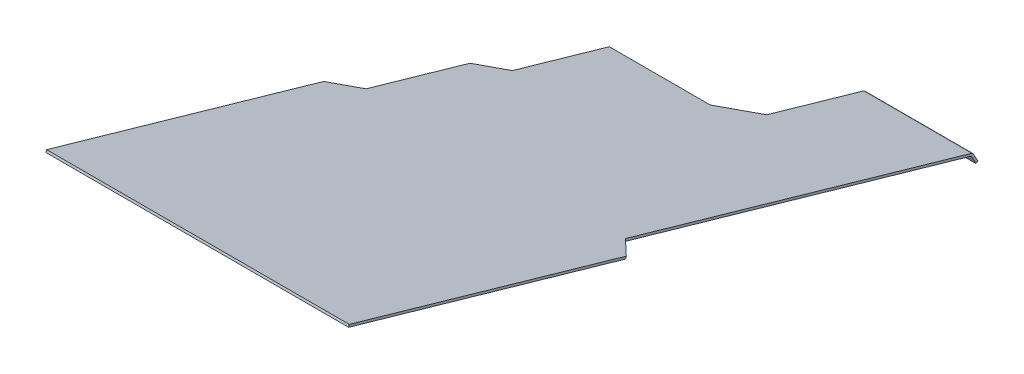
ISO-10303-21;
HEADER;
FILE_DESCRIPTION(('STEP AP214'),'2;1');
FILE_NAME('part.step','',(''),(''),'','','');
FILE_SCHEMA(('AUTOMOTIVE_DESIGN { 1 0 10303 214 1 1 1 1 }'));
ENDSEC;
DATA;
#1=APPLICATION_CONTEXT('core data for automotive mechanical design processes');
#2=APPLICATION_PROTOCOL_DEFINITION('international standard','automotive_design',2000,#1);
#3=PRODUCT_CONTEXT('',#1,'mechanical');
#4=PRODUCT('Part','Part','',(#3));
#5=PRODUCT_RELATED_PRODUCT_CATEGORY('part','',(#4));
#6=PRODUCT_DEFINITION_FORMATION('','',#4);
#7=PRODUCT_DEFINITION_CONTEXT('part definition',#1,'design');
#8=PRODUCT_DEFINITION('design','',#6,#7);
#9=PRODUCT_DEFINITION_SHAPE('','',#8);
#10=(LENGTH_UNIT() NAMED_UNIT(*) SI_UNIT(.MILLI.,.METRE.));
#11=(NAMED_UNIT(*) PLANE_ANGLE_UNIT() SI_UNIT($,.RADIAN.));
#12=(NAMED_UNIT(*) SI_UNIT($,.STERADIAN.) SOLID_ANGLE_UNIT());
#13=UNCERTAINTY_MEASURE_WITH_UNIT(LENGTH_MEASURE(1.E-05),#10,'distance_accuracy_value','');
#14=(GEOMETRIC_REPRESENTATION_CONTEXT(3) GLOBAL_UNCERTAINTY_ASSIGNED_CONTEXT((#13)) GLOBAL_UNIT_ASSIGNED_CONTEXT((#10,
#11,#12)) REPRESENTATION_CONTEXT('',''));
#15=CARTESIAN_POINT('',(0.,0.,0.));
#16=DIRECTION('',(0.,0.,1.));
#17=DIRECTION('',(1.,0.,0.));
#18=AXIS2_PLACEMENT_3D('',#15,#16,#17);
#19=CARTESIAN_POINT('',(105.,8.15369874467239,-236.405408560763));
#20=DIRECTION('',(-1.,0.,0.));
#21=DIRECTION('',(0.,-0.275637355816999,-0.961261695938319));
#22=AXIS2_PLACEMENT_3D('',#19,#20,#21);
#23=PLANE('',#22);
#24=DIRECTION('',(0.,-0.275637355816999,-0.961261695938319));
#25=VECTOR('',#24,1.);
#26=CARTESIAN_POINT('',(105.,6.61568003117108,-235.964388791456));
#27=LINE('',#26,#25);
#28=CARTESIAN_POINT('',(105.,6.61568003117108,-235.964388791456));
#29=VERTEX_POINT('',#28);
#30=CARTESIAN_POINT('',(105.,-48.5117911322299,-428.216727979123));
#31=VERTEX_POINT('',#30);
#32=EDGE_CURVE('E231',#29,#31,#27,.T.);
#33=ORIENTED_EDGE('',*,*,#32,.T.);
#34=DIRECTION('',(0.,0.961261695938319,-0.275637355816999));
#35=VECTOR('',#34,1.);
#36=CARTESIAN_POINT('',(105.,-46.9737724187286,-428.65774774843));
#37=LINE('',#36,#35);
#38=CARTESIAN_POINT('',(105.,-46.9737724187286,-428.65774774843));
#39=VERTEX_POINT('',#38);
#40=EDGE_CURVE('E163',#31,#39,#37,.T.);
#41=ORIENTED_EDGE('',*,*,#40,.T.);
#42=DIRECTION('',(0.,-0.275637355816999,-0.961261695938319));
#43=VECTOR('',#42,1.);
#44=CARTESIAN_POINT('',(105.,8.15369874467239,-236.405408560763));
#45=LINE('',#44,#43);
#46=CARTESIAN_POINT('',(105.,8.15369874467239,-236.405408560763));
#47=VERTEX_POINT('',#46);
#48=EDGE_CURVE('E237',#47,#39,#45,.T.);
#49=ORIENTED_EDGE('',*,*,#48,.F.);
#50=DIRECTION('',(0.,-0.961261695938319,0.275637355816999));
#51=VECTOR('',#50,1.);
#52=CARTESIAN_POINT('',(105.,8.15369874467239,-236.405408560763));
#53=LINE('',#52,#51);
#54=EDGE_CURVE('E217',#47,#29,#53,.T.);
#55=ORIENTED_EDGE('',*,*,#54,.T.);
#56=EDGE_LOOP('',(#33,#41,#49,#55));
#57=FACE_BOUND('',#56,.T.);
#58=ADVANCED_FACE('F18',(#57),#23,.F.);
#59=CARTESIAN_POINT('',(-105.,8.15369874467239,-236.405408560763));
#60=DIRECTION('',(-1.,0.,0.));
#61=DIRECTION('',(0.,-0.275637355816999,-0.961261695938319));
#62=AXIS2_PLACEMENT_3D('',#59,#60,#61);
#63=PLANE('',#62);
#64=DIRECTION('',(0.,0.961261695938319,-0.275637355816999));
#65=VECTOR('',#64,1.);
#66=CARTESIAN_POINT('',(-105.,-46.9737724187285,-428.65774774843));
#67=LINE('',#66,#65);
#68=CARTESIAN_POINT('',(-105.,-48.5117911322299,-428.216727979123));
#69=VERTEX_POINT('',#68);
#70=CARTESIAN_POINT('',(-105.,-46.9737724187285,-428.65774774843));
#71=VERTEX_POINT('',#70);
#72=EDGE_CURVE('E286',#69,#71,#67,.T.);
#73=ORIENTED_EDGE('',*,*,#72,.F.);
#74=DIRECTION('',(0.,-0.275637355816999,-0.961261695938319));
#75=VECTOR('',#74,1.);
#76=CARTESIAN_POINT('',(-105.,6.61568003117108,-235.964388791456));
#77=LINE('',#76,#75);
#78=CARTESIAN_POINT('',(-105.,6.61568003117108,-235.964388791456));
#79=VERTEX_POINT('',#78);
#80=EDGE_CURVE('E192',#79,#69,#77,.T.);
#81=ORIENTED_EDGE('',*,*,#80,.F.);
#82=DIRECTION('',(0.,-0.961261695938319,0.275637355816999));
#83=VECTOR('',#82,1.);
#84=CARTESIAN_POINT('',(-105.,8.15369874467239,-236.405408560763));
#85=LINE('',#84,#83);
#86=CARTESIAN_POINT('',(-105.,8.15369874467239,-236.405408560763));
#87=VERTEX_POINT('',#86);
#88=EDGE_CURVE('E213',#87,#79,#85,.T.);
#89=ORIENTED_EDGE('',*,*,#88,.F.);
#90=DIRECTION('',(0.,-0.275637355816999,-0.961261695938319));
#91=VECTOR('',#90,1.);
#92=CARTESIAN_POINT('',(-105.,8.15369874467239,-236.405408560763));
#93=LINE('',#92,#91);
#94=EDGE_CURVE('E227',#87,#71,#93,.T.);
#95=ORIENTED_EDGE('',*,*,#94,.T.);
#96=EDGE_LOOP('',(#73,#81,#89,#95));
#97=FACE_BOUND('',#96,.T.);
#98=ADVANCED_FACE('F303',(#97),#63,.T.);
#99=CARTESIAN_POINT('',(-105.,8.15369874467239,-236.405408560763));
#100=DIRECTION('',(0.,-0.275637355816999,-0.961261695938319));
#101=DIRECTION('',(1.,0.,0.));
#102=AXIS2_PLACEMENT_3D('',#99,#100,#101);
#103=PLANE('',#102);
#104=DIRECTION('',(1.,0.,0.));
#105=VECTOR('',#104,1.);
#106=CARTESIAN_POINT('',(-105.,8.15369874467239,-236.405408560763));
#107=LINE('',#106,#105);
#108=EDGE_CURVE('E225',#87,#47,#107,.T.);
#109=ORIENTED_EDGE('',*,*,#108,.F.);
#110=ORIENTED_EDGE('',*,*,#88,.T.);
#111=DIRECTION('',(1.,0.,0.));
#112=VECTOR('',#111,1.);
#113=CARTESIAN_POINT('',(-105.,6.61568003117108,-235.964388791456));
#114=LINE('',#113,#112);
#115=EDGE_CURVE('E234',#79,#29,#114,.T.);
#116=ORIENTED_EDGE('',*,*,#115,.T.);
#117=ORIENTED_EDGE('',*,*,#54,.F.);
#118=EDGE_LOOP('',(#109,#110,#116,#117));
#119=FACE_BOUND('',#118,.T.);
#120=ADVANCED_FACE('F310',(#119),#103,.F.);
#121=CARTESIAN_POINT('',(-105.,6.61568003117108,-235.964388791456));
#122=DIRECTION('',(0.,-0.961261695938319,0.275637355816999));
#123=DIRECTION('',(0.,-0.275637355816999,-0.961261695938319));
#124=AXIS2_PLACEMENT_3D('',#121,#122,#123);
#125=PLANE('',#124);
#126=DIRECTION('',(1.,0.,0.));
#127=VECTOR('',#126,1.);
#128=CARTESIAN_POINT('',(15.,-121.555462078273,-682.950281067515));
#129=LINE('',#128,#127);
#130=CARTESIAN_POINT('',(15.,-121.555462078273,-682.950281067515));
#131=VERTEX_POINT('',#130);
#132=CARTESIAN_POINT('',(90.,-121.555462078273,-682.950281067515));
#133=VERTEX_POINT('',#132);
#134=EDGE_CURVE('E145',#131,#133,#129,.T.);
#135=ORIENTED_EDGE('',*,*,#134,.T.);
#136=DIRECTION('',(0.,-0.275637355816999,-0.961261695938319));
#137=VECTOR('',#136,1.);
#138=CARTESIAN_POINT('',(90.,6.61568003117108,-235.964388791456));
#139=LINE('',#138,#137);
#140=CARTESIAN_POINT('',(90.,-52.6463514694849,-442.635653418198));
#141=VERTEX_POINT('',#140);
#142=EDGE_CURVE('E172',#141,#133,#139,.T.);
#143=ORIENTED_EDGE('',*,*,#142,.F.);
#144=DIRECTION('',(-0.707106781186549,-0.19490504344653,-0.679714663692865));
#145=VECTOR('',#144,1.);
#146=CARTESIAN_POINT('',(100.000000000002,-49.8899779113144,-433.023036458813));
#147=LINE('',#146,#145);
#148=EDGE_CURVE('E288',#31,#141,#147,.T.);
#149=ORIENTED_EDGE('',*,*,#148,.F.);
#150=ORIENTED_EDGE('',*,*,#32,.F.);
#151=ORIENTED_EDGE('',*,*,#115,.F.);
#152=ORIENTED_EDGE('',*,*,#80,.T.);
#153=DIRECTION('',(-0.707106781186549,0.19490504344653,0.679714663692866));
#154=VECTOR('',#153,1.);
#155=CARTESIAN_POINT('',(-205.,-20.9480555505295,-332.09055838529));
#156=LINE('',#155,#154);
#157=CARTESIAN_POINT('',(-90.,-52.6463514694849,-442.635653418197));
#158=VERTEX_POINT('',#157);
#159=EDGE_CURVE('E277',#158,#69,#156,.T.);
#160=ORIENTED_EDGE('',*,*,#159,.F.);
#161=DIRECTION('',(0.,-0.275637355816999,-0.961261695938319));
#162=VECTOR('',#161,1.);
#163=CARTESIAN_POINT('',(-90.,6.61568003117108,-235.964388791456));
#164=LINE('',#163,#162);
#165=CARTESIAN_POINT('',(-90.,-73.3191531557598,-514.730280613572));
#166=VERTEX_POINT('',#165);
#167=EDGE_CURVE('E280',#166,#158,#164,.F.);
#168=ORIENTED_EDGE('',*,*,#167,.F.);
#169=DIRECTION('',(0.707106781186549,-0.19490504344653,-0.679714663692866));
#170=VECTOR('',#169,1.);
#171=CARTESIAN_POINT('',(-242.5,-31.284456393667,-368.137871982976));
#172=LINE('',#171,#170);
#173=CARTESIAN_POINT('',(-75.,-77.4537134930148,-529.149206052646));
#174=VERTEX_POINT('',#173);
#175=EDGE_CURVE('E186',#166,#174,#172,.T.);
#176=ORIENTED_EDGE('',*,*,#175,.T.);
#177=DIRECTION('',(0.,-0.275637355816999,-0.961261695938319));
#178=VECTOR('',#177,1.);
#179=CARTESIAN_POINT('',(-75.,6.61568003117108,-235.964388791456));
#180=LINE('',#179,#178);
#181=CARTESIAN_POINT('',(-75.,-96.7483284002037,-596.437524768325));
#182=VERTEX_POINT('',#181);
#183=EDGE_CURVE('E253',#174,#182,#180,.T.);
#184=ORIENTED_EDGE('',*,*,#183,.T.);
#185=DIRECTION('',(1.,0.,0.));
#186=VECTOR('',#185,1.);
#187=CARTESIAN_POINT('',(-105.,-96.7483284002037,-596.437524768325));
#188=LINE('',#187,#186);
#189=CARTESIAN_POINT('',(-4.99999999999974,-96.7483284002037,-596.437524768325));
#190=VERTEX_POINT('',#189);
#191=EDGE_CURVE('E209',#182,#190,#188,.T.);
#192=ORIENTED_EDGE('',*,*,#191,.T.);
#193=DIRECTION('',(-0.707106781186547,0.19490504344653,0.679714663692867));
#194=VECTOR('',#193,1.);
#195=CARTESIAN_POINT('',(15.,-102.261075516544,-615.662758687091));
#196=LINE('',#195,#194);
#197=CARTESIAN_POINT('',(15.0000000000002,-102.261075516544,-615.662758687092));
#198=VERTEX_POINT('',#197);
#199=EDGE_CURVE('E11',#190,#198,#196,.F.);
#200=ORIENTED_EDGE('',*,*,#199,.T.);
#201=DIRECTION('',(0.,-0.275637355816999,-0.961261695938319));
#202=VECTOR('',#201,1.);
#203=CARTESIAN_POINT('',(15.0000000000002,6.61568003117108,-235.964388791456));
#204=LINE('',#203,#202);
#205=EDGE_CURVE('E185',#198,#131,#204,.T.);
#206=ORIENTED_EDGE('',*,*,#205,.T.);
#207=EDGE_LOOP('',(#135,#143,#149,#150,#151,#152,#160,#168,#176,#184,#192,#200,#206));
#208=FACE_BOUND('',#207,.T.);
#209=ADVANCED_FACE('F313',(#208),#125,.T.);
#210=CARTESIAN_POINT('',(-105.,8.15369874467239,-236.405408560763));
#211=DIRECTION('',(0.,-0.961261695938319,0.275637355816999));
#212=DIRECTION('',(0.,-0.275637355816999,-0.961261695938319));
#213=AXIS2_PLACEMENT_3D('',#210,#211,#212);
#214=PLANE('',#213);
#215=DIRECTION('',(0.,-0.275637355816999,-0.961261695938319));
#216=VECTOR('',#215,1.);
#217=CARTESIAN_POINT('',(90.,8.15369874467239,-236.405408560763));
#218=LINE('',#217,#216);
#219=CARTESIAN_POINT('',(90.,-51.1083327559835,-443.076673187505));
#220=VERTEX_POINT('',#219);
#221=CARTESIAN_POINT('',(90.,-120.017443364771,-683.391300836822));
#222=VERTEX_POINT('',#221);
#223=EDGE_CURVE('E152',#220,#222,#218,.T.);
#224=ORIENTED_EDGE('',*,*,#223,.T.);
#225=DIRECTION('',(1.,0.,0.));
#226=VECTOR('',#225,1.);
#227=CARTESIAN_POINT('',(15.,-120.017443364771,-683.391300836822));
#228=LINE('',#227,#226);
#229=CARTESIAN_POINT('',(15.,-120.017443364771,-683.391300836822));
#230=VERTEX_POINT('',#229);
#231=EDGE_CURVE('E137',#230,#222,#228,.T.);
#232=ORIENTED_EDGE('',*,*,#231,.F.);
#233=DIRECTION('',(0.,-0.275637355816999,-0.961261695938319));
#234=VECTOR('',#233,1.);
#235=CARTESIAN_POINT('',(15.,8.15369874467239,-236.405408560763));
#236=LINE('',#235,#234);
#237=CARTESIAN_POINT('',(15.,-100.723056803042,-616.103778456399));
#238=VERTEX_POINT('',#237);
#239=EDGE_CURVE('E199',#238,#230,#236,.T.);
#240=ORIENTED_EDGE('',*,*,#239,.F.);
#241=DIRECTION('',(0.707106781186547,-0.19490504344653,-0.679714663692867));
#242=VECTOR('',#241,1.);
#243=CARTESIAN_POINT('',(-242.5,-29.746437680165,-368.578891752281));
#244=LINE('',#243,#242);
#245=CARTESIAN_POINT('',(-4.9999999999998,-95.2103096867024,-596.878544537632));
#246=VERTEX_POINT('',#245);
#247=EDGE_CURVE('E26',#238,#246,#244,.F.);
#248=ORIENTED_EDGE('',*,*,#247,.T.);
#249=DIRECTION('',(1.,0.,0.));
#250=VECTOR('',#249,1.);
#251=CARTESIAN_POINT('',(-105.,-95.2103096867024,-596.878544537632));
#252=LINE('',#251,#250);
#253=CARTESIAN_POINT('',(-75.,-95.2103096867024,-596.878544537632));
#254=VERTEX_POINT('',#253);
#255=EDGE_CURVE('E204',#254,#246,#252,.T.);
#256=ORIENTED_EDGE('',*,*,#255,.F.);
#257=DIRECTION('',(0.,-0.275637355816999,-0.961261695938319));
#258=VECTOR('',#257,1.);
#259=CARTESIAN_POINT('',(-75.,8.15369874467239,-236.405408560763));
#260=LINE('',#259,#258);
#261=CARTESIAN_POINT('',(-75.,-75.9156947795135,-529.590225821954));
#262=VERTEX_POINT('',#261);
#263=EDGE_CURVE('E184',#262,#254,#260,.T.);
#264=ORIENTED_EDGE('',*,*,#263,.F.);
#265=DIRECTION('',(0.707106781186549,-0.19490504344653,-0.679714663692866));
#266=VECTOR('',#265,1.);
#267=CARTESIAN_POINT('',(-242.5,-29.7464376801656,-368.578891752284));
#268=LINE('',#267,#266);
#269=CARTESIAN_POINT('',(-90.,-71.7811344422585,-515.171300382879));
#270=VERTEX_POINT('',#269);
#271=EDGE_CURVE('E180',#270,#262,#268,.T.);
#272=ORIENTED_EDGE('',*,*,#271,.F.);
#273=DIRECTION('',(0.,0.275637355816999,0.961261695938319));
#274=VECTOR('',#273,1.);
#275=CARTESIAN_POINT('',(-90.,8.15369874467239,-236.405408560763));
#276=LINE('',#275,#274);
#277=CARTESIAN_POINT('',(-90.,-51.1083327559835,-443.076673187505));
#278=VERTEX_POINT('',#277);
#279=EDGE_CURVE('E273',#270,#278,#276,.T.);
#280=ORIENTED_EDGE('',*,*,#279,.T.);
#281=DIRECTION('',(-0.707106781186549,0.19490504344653,0.679714663692866));
#282=VECTOR('',#281,1.);
#283=CARTESIAN_POINT('',(-205.,-19.4100368370282,-332.531578154597));
#284=LINE('',#283,#282);
#285=EDGE_CURVE('E272',#278,#71,#284,.T.);
#286=ORIENTED_EDGE('',*,*,#285,.T.);
#287=ORIENTED_EDGE('',*,*,#94,.F.);
#288=ORIENTED_EDGE('',*,*,#108,.T.);
#289=ORIENTED_EDGE('',*,*,#48,.T.);
#290=DIRECTION('',(-0.707106781186549,-0.19490504344653,-0.679714663692865));
#291=VECTOR('',#290,1.);
#292=CARTESIAN_POINT('',(100.000000000002,-48.3519591978131,-433.464056228121));
#293=LINE('',#292,#291);
#294=EDGE_CURVE('E161',#39,#220,#293,.T.);
#295=ORIENTED_EDGE('',*,*,#294,.T.);
#296=EDGE_LOOP('',(#224,#232,#240,#248,#256,#264,#272,#280,#286,#287,#288,#289,#295));
#297=FACE_BOUND('',#296,.T.);
#298=ADVANCED_FACE('F159',(#297),#214,.F.);
#299=CARTESIAN_POINT('',(-75.,8.15369874467239,-236.405408560763));
#300=DIRECTION('',(-1.,0.,0.));
#301=DIRECTION('',(0.,-0.275637355816999,-0.961261695938319));
#302=AXIS2_PLACEMENT_3D('',#299,#300,#301);
#303=PLANE('',#302);
#304=DIRECTION('',(0.,0.961261695938319,-0.275637355816999));
#305=VECTOR('',#304,1.);
#306=CARTESIAN_POINT('',(-75.,-95.2103096867024,-596.878544537632));
#307=LINE('',#306,#305);
#308=EDGE_CURVE('E203',#182,#254,#307,.T.);
#309=ORIENTED_EDGE('',*,*,#308,.F.);
#310=ORIENTED_EDGE('',*,*,#183,.F.);
#311=DIRECTION('',(0.,0.961261695938319,-0.275637355816999));
#312=VECTOR('',#311,1.);
#313=CARTESIAN_POINT('',(-75.,-75.9156947795135,-529.590225821954));
#314=LINE('',#313,#312);
#315=EDGE_CURVE('E240',#174,#262,#314,.T.);
#316=ORIENTED_EDGE('',*,*,#315,.T.);
#317=ORIENTED_EDGE('',*,*,#263,.T.);
#318=EDGE_LOOP('',(#309,#310,#316,#317));
#319=FACE_BOUND('',#318,.T.);
#320=ADVANCED_FACE('F345',(#319),#303,.T.);
#321=CARTESIAN_POINT('',(-105.,-95.2103096867024,-596.878544537632));
#322=DIRECTION('',(0.,-0.275637355816999,-0.961261695938319));
#323=DIRECTION('',(1.,0.,0.));
#324=AXIS2_PLACEMENT_3D('',#321,#322,#323);
#325=PLANE('',#324);
#326=ORIENTED_EDGE('',*,*,#255,.T.);
#327=DIRECTION('',(0.,0.961261695938319,-0.275637355816999));
#328=VECTOR('',#327,1.);
#329=CARTESIAN_POINT('',(-4.9999999999998,-96.7483284002037,-596.437524768325));
#330=LINE('',#329,#328);
#331=EDGE_CURVE('E39',#246,#190,#330,.F.);
#332=ORIENTED_EDGE('',*,*,#331,.T.);
#333=ORIENTED_EDGE('',*,*,#191,.F.);
#334=ORIENTED_EDGE('',*,*,#308,.T.);
#335=EDGE_LOOP('',(#326,#332,#333,#334));
#336=FACE_BOUND('',#335,.T.);
#337=ADVANCED_FACE('F348',(#336),#325,.T.);
#338=CARTESIAN_POINT('',(15.,8.15369874467239,-236.405408560763));
#339=DIRECTION('',(-1.,0.,0.));
#340=DIRECTION('',(0.,-0.275637355816999,-0.961261695938319));
#341=AXIS2_PLACEMENT_3D('',#338,#339,#340);
#342=PLANE('',#341);
#343=ORIENTED_EDGE('',*,*,#205,.F.);
#344=DIRECTION('',(0.,-0.961261695938319,0.275637355816999));
#345=VECTOR('',#344,1.);
#346=CARTESIAN_POINT('',(15.,-100.723056803042,-616.103778456399));
#347=LINE('',#346,#345);
#348=EDGE_CURVE('E210',#198,#238,#347,.F.);
#349=ORIENTED_EDGE('',*,*,#348,.T.);
#350=ORIENTED_EDGE('',*,*,#239,.T.);
#351=CARTESIAN_POINT('',(15.,-121.557384601664,-682.949729792803));
#352=DIRECTION('',(-1.,0.,0.));
#353=DIRECTION('',(0.,-0.961261695938319,0.275637355816999));
#354=AXIS2_PLACEMENT_3D('',#351,#352,#353);
#355=CIRCLE('',#354,1.602);
#356=CARTESIAN_POINT('',(15.,-120.78071959003,-684.35087056364));
#357=VERTEX_POINT('',#356);
#358=EDGE_CURVE('E143',#230,#357,#355,.T.);
#359=ORIENTED_EDGE('',*,*,#358,.T.);
#360=DIRECTION('',(0.,0.874619707139396,0.484809620246337));
#361=VECTOR('',#360,1.);
#362=CARTESIAN_POINT('',(15.,-120.59868454144,-684.249966888525));
#363=LINE('',#362,#361);
#364=CARTESIAN_POINT('',(15.,-126.902332981316,-687.744136275925));
#365=VERTEX_POINT('',#364);
#366=EDGE_CURVE('E839',#365,#357,#363,.T.);
#367=ORIENTED_EDGE('',*,*,#366,.F.);
#368=DIRECTION('',(0.,-0.484809620246331,0.874619707139399));
#369=VECTOR('',#368,1.);
#370=CARTESIAN_POINT('',(15.,-126.902332981316,-687.744136275925));
#371=LINE('',#370,#369);
#372=CARTESIAN_POINT('',(15.,-127.67802837371,-686.344744744502));
#373=VERTEX_POINT('',#372);
#374=EDGE_CURVE('E855',#365,#373,#371,.T.);
#375=ORIENTED_EDGE('',*,*,#374,.T.);
#376=DIRECTION('',(0.,0.874619707139396,0.484809620246337));
#377=VECTOR('',#376,1.);
#378=CARTESIAN_POINT('',(15.,-121.374379933834,-682.850575357102));
#379=LINE('',#378,#377);
#380=CARTESIAN_POINT('',(15.,-121.556414982424,-682.951479032217));
#381=VERTEX_POINT('',#380);
#382=EDGE_CURVE('E850',#373,#381,#379,.T.);
#383=ORIENTED_EDGE('',*,*,#382,.T.);
#384=CARTESIAN_POINT('',(15.,-121.557384601664,-682.949729792803));
#385=DIRECTION('',(1.,0.,0.));
#386=DIRECTION('',(0.,0.961261695938319,-0.275637355816999));
#387=AXIS2_PLACEMENT_3D('',#384,#385,#386);
#388=CIRCLE('',#387,0.00200000000000005);
#389=EDGE_CURVE('E156',#131,#381,#388,.F.);
#390=ORIENTED_EDGE('',*,*,#389,.F.);
#391=EDGE_LOOP('',(#343,#349,#350,#359,#367,#375,#383,#390));
#392=FACE_BOUND('',#391,.T.);
#393=ADVANCED_FACE('F379',(#392),#342,.T.);
#394=CARTESIAN_POINT('',(-242.5,-29.7464376801656,-368.578891752284));
#395=DIRECTION('',(-0.707106781186547,-0.19490504344653,-0.679714663692867));
#396=DIRECTION('',(0.707106781186549,-0.19490504344653,-0.679714663692866));
#397=AXIS2_PLACEMENT_3D('',#394,#395,#396);
#398=PLANE('',#397);
#399=ORIENTED_EDGE('',*,*,#175,.F.);
#400=DIRECTION('',(0.,0.961261695938319,-0.275637355816999));
#401=VECTOR('',#400,1.);
#402=CARTESIAN_POINT('',(-90.,-71.7811344422585,-515.171300382879));
#403=LINE('',#402,#401);
#404=EDGE_CURVE('E268',#166,#270,#403,.T.);
#405=ORIENTED_EDGE('',*,*,#404,.T.);
#406=ORIENTED_EDGE('',*,*,#271,.T.);
#407=ORIENTED_EDGE('',*,*,#315,.F.);
#408=EDGE_LOOP('',(#399,#405,#406,#407));
#409=FACE_BOUND('',#408,.T.);
#410=ADVANCED_FACE('F347',(#409),#398,.T.);
#411=CARTESIAN_POINT('',(90.,8.15369874467239,-236.405408560763));
#412=DIRECTION('',(-1.,0.,0.));
#413=DIRECTION('',(0.,-0.275637355816999,-0.961261695938319));
#414=AXIS2_PLACEMENT_3D('',#411,#412,#413);
#415=PLANE('',#414);
#416=ORIENTED_EDGE('',*,*,#142,.T.);
#417=CARTESIAN_POINT('',(90.,-121.557384601664,-682.949729792803));
#418=DIRECTION('',(1.,0.,0.));
#419=DIRECTION('',(0.,0.961261695938319,-0.275637355816999));
#420=AXIS2_PLACEMENT_3D('',#417,#418,#419);
#421=CIRCLE('',#420,0.00200000000000005);
#422=CARTESIAN_POINT('',(90.,-121.556414982424,-682.951479032217));
#423=VERTEX_POINT('',#422);
#424=EDGE_CURVE('E322',#423,#133,#421,.T.);
#425=ORIENTED_EDGE('',*,*,#424,.F.);
#426=DIRECTION('',(0.,-0.874619707139396,-0.484809620246337));
#427=VECTOR('',#426,1.);
#428=CARTESIAN_POINT('',(90.,-121.374379933834,-682.850575357102));
#429=LINE('',#428,#427);
#430=CARTESIAN_POINT('',(90.,-127.67802837371,-686.344744744502));
#431=VERTEX_POINT('',#430);
#432=EDGE_CURVE('E845',#423,#431,#429,.T.);
#433=ORIENTED_EDGE('',*,*,#432,.T.);
#434=DIRECTION('',(0.,-0.484809620246331,0.874619707139399));
#435=VECTOR('',#434,1.);
#436=CARTESIAN_POINT('',(90.,-126.902332981316,-687.744136275925));
#437=LINE('',#436,#435);
#438=CARTESIAN_POINT('',(90.,-126.902332981316,-687.744136275925));
#439=VERTEX_POINT('',#438);
#440=EDGE_CURVE('E146',#439,#431,#437,.T.);
#441=ORIENTED_EDGE('',*,*,#440,.F.);
#442=DIRECTION('',(0.,-0.874619707139396,-0.484809620246337));
#443=VECTOR('',#442,1.);
#444=CARTESIAN_POINT('',(90.,-120.59868454144,-684.249966888525));
#445=LINE('',#444,#443);
#446=CARTESIAN_POINT('',(90.,-120.78071959003,-684.35087056364));
#447=VERTEX_POINT('',#446);
#448=EDGE_CURVE('E155',#447,#439,#445,.T.);
#449=ORIENTED_EDGE('',*,*,#448,.F.);
#450=CARTESIAN_POINT('',(90.,-121.557384601664,-682.949729792803));
#451=DIRECTION('',(1.,0.,0.));
#452=DIRECTION('',(0.,-0.961261695938319,0.275637355816999));
#453=AXIS2_PLACEMENT_3D('',#450,#451,#452);
#454=CIRCLE('',#453,1.602);
#455=EDGE_CURVE('E141',#447,#222,#454,.T.);
#456=ORIENTED_EDGE('',*,*,#455,.T.);
#457=ORIENTED_EDGE('',*,*,#223,.F.);
#458=DIRECTION('',(0.,0.961261695938319,-0.275637355816999));
#459=VECTOR('',#458,1.);
#460=CARTESIAN_POINT('',(90.,-51.1083327559835,-443.076673187505));
#461=LINE('',#460,#459);
#462=EDGE_CURVE('E170',#141,#220,#461,.T.);
#463=ORIENTED_EDGE('',*,*,#462,.F.);
#464=EDGE_LOOP('',(#416,#425,#433,#441,#449,#456,#457,#463));
#465=FACE_BOUND('',#464,.T.);
#466=ADVANCED_FACE('F151',(#465),#415,.F.);
#467=CARTESIAN_POINT('',(100.000000000002,-48.3519591978131,-433.464056228121));
#468=DIRECTION('',(-0.707106781186547,0.19490504344653,0.679714663692868));
#469=DIRECTION('',(-0.707106781186549,-0.19490504344653,-0.679714663692865));
#470=AXIS2_PLACEMENT_3D('',#467,#468,#469);
#471=PLANE('',#470);
#472=ORIENTED_EDGE('',*,*,#462,.T.);
#473=ORIENTED_EDGE('',*,*,#294,.F.);
#474=ORIENTED_EDGE('',*,*,#40,.F.);
#475=ORIENTED_EDGE('',*,*,#148,.T.);
#476=EDGE_LOOP('',(#472,#473,#474,#475));
#477=FACE_BOUND('',#476,.T.);
#478=ADVANCED_FACE('F320',(#477),#471,.F.);
#479=CARTESIAN_POINT('',(-205.,-19.4100368370282,-332.531578154597));
#480=DIRECTION('',(0.707106781186547,0.19490504344653,0.679714663692868));
#481=DIRECTION('',(-0.707106781186549,0.19490504344653,0.679714663692866));
#482=AXIS2_PLACEMENT_3D('',#479,#480,#481);
#483=PLANE('',#482);
#484=ORIENTED_EDGE('',*,*,#72,.T.);
#485=ORIENTED_EDGE('',*,*,#285,.F.);
#486=DIRECTION('',(0.,0.961261695938319,-0.275637355816999));
#487=VECTOR('',#486,1.);
#488=CARTESIAN_POINT('',(-90.,-51.1083327559835,-443.076673187505));
#489=LINE('',#488,#487);
#490=EDGE_CURVE('E271',#158,#278,#489,.T.);
#491=ORIENTED_EDGE('',*,*,#490,.F.);
#492=ORIENTED_EDGE('',*,*,#159,.T.);
#493=EDGE_LOOP('',(#484,#485,#491,#492));
#494=FACE_BOUND('',#493,.T.);
#495=ADVANCED_FACE('F394',(#494),#483,.F.);
#496=CARTESIAN_POINT('',(-90.,8.15369874467239,-236.405408560763));
#497=DIRECTION('',(1.,0.,0.));
#498=DIRECTION('',(0.,0.275637355816999,0.961261695938319));
#499=AXIS2_PLACEMENT_3D('',#496,#497,#498);
#500=PLANE('',#499);
#501=ORIENTED_EDGE('',*,*,#490,.T.);
#502=ORIENTED_EDGE('',*,*,#279,.F.);
#503=ORIENTED_EDGE('',*,*,#404,.F.);
#504=ORIENTED_EDGE('',*,*,#167,.T.);
#505=EDGE_LOOP('',(#501,#502,#503,#504));
#506=FACE_BOUND('',#505,.T.);
#507=ADVANCED_FACE('F397',(#506),#500,.F.);
#508=CARTESIAN_POINT('',(15.,-120.59868454144,-684.249966888525));
#509=DIRECTION('',(0.,0.484809620246337,-0.874619707139396));
#510=DIRECTION('',(0.,0.874619707139396,0.484809620246337));
#511=AXIS2_PLACEMENT_3D('',#508,#509,#510);
#512=PLANE('',#511);
#513=ORIENTED_EDGE('',*,*,#366,.T.);
#514=DIRECTION('',(1.,0.,0.));
#515=VECTOR('',#514,1.);
#516=CARTESIAN_POINT('',(15.,-120.78071959003,-684.35087056364));
#517=LINE('',#516,#515);
#518=EDGE_CURVE('E840',#357,#447,#517,.T.);
#519=ORIENTED_EDGE('',*,*,#518,.T.);
#520=ORIENTED_EDGE('',*,*,#448,.T.);
#521=DIRECTION('',(-1.,0.,0.));
#522=VECTOR('',#521,1.);
#523=CARTESIAN_POINT('',(90.,-126.902332981316,-687.744136275925));
#524=LINE('',#523,#522);
#525=EDGE_CURVE('E842',#439,#365,#524,.T.);
#526=ORIENTED_EDGE('',*,*,#525,.T.);
#527=EDGE_LOOP('',(#513,#519,#520,#526));
#528=FACE_BOUND('',#527,.T.);
#529=ADVANCED_FACE('F400',(#528),#512,.T.);
#530=CARTESIAN_POINT('',(15.,-121.374379933834,-682.850575357102));
#531=DIRECTION('',(0.,0.484809620246337,-0.874619707139396));
#532=DIRECTION('',(0.,0.874619707139396,0.484809620246337));
#533=AXIS2_PLACEMENT_3D('',#530,#531,#532);
#534=PLANE('',#533);
#535=DIRECTION('',(1.,0.,0.));
#536=VECTOR('',#535,1.);
#537=CARTESIAN_POINT('',(15.,-121.556414982424,-682.951479032217));
#538=LINE('',#537,#536);
#539=EDGE_CURVE('E848',#381,#423,#538,.T.);
#540=ORIENTED_EDGE('',*,*,#539,.F.);
#541=ORIENTED_EDGE('',*,*,#382,.F.);
#542=DIRECTION('',(-1.,0.,0.));
#543=VECTOR('',#542,1.);
#544=CARTESIAN_POINT('',(90.,-127.67802837371,-686.344744744502));
#545=LINE('',#544,#543);
#546=EDGE_CURVE('E859',#431,#373,#545,.T.);
#547=ORIENTED_EDGE('',*,*,#546,.F.);
#548=ORIENTED_EDGE('',*,*,#432,.F.);
#549=EDGE_LOOP('',(#540,#541,#547,#548));
#550=FACE_BOUND('',#549,.T.);
#551=ADVANCED_FACE('F405',(#550),#534,.F.);
#552=CARTESIAN_POINT('',(90.,-126.902332981316,-687.744136275925));
#553=DIRECTION('',(0.,0.874619707139399,0.484809620246331));
#554=DIRECTION('',(0.,-0.484809620246331,0.874619707139399));
#555=AXIS2_PLACEMENT_3D('',#552,#553,#554);
#556=PLANE('',#555);
#557=ORIENTED_EDGE('',*,*,#546,.T.);
#558=ORIENTED_EDGE('',*,*,#374,.F.);
#559=ORIENTED_EDGE('',*,*,#525,.F.);
#560=ORIENTED_EDGE('',*,*,#440,.T.);
#561=EDGE_LOOP('',(#557,#558,#559,#560));
#562=FACE_BOUND('',#561,.T.);
#563=ADVANCED_FACE('F402',(#562),#556,.F.);
#564=CARTESIAN_POINT('',(15.,-121.557384601664,-682.949729792803));
#565=DIRECTION('',(1.,0.,0.));
#566=DIRECTION('',(0.,-0.961261695938319,0.275637355816999));
#567=AXIS2_PLACEMENT_3D('',#564,#565,#566);
#568=CYLINDRICAL_SURFACE('',#567,1.602);
#569=ORIENTED_EDGE('',*,*,#455,.F.);
#570=ORIENTED_EDGE('',*,*,#518,.F.);
#571=ORIENTED_EDGE('',*,*,#358,.F.);
#572=ORIENTED_EDGE('',*,*,#231,.T.);
#573=EDGE_LOOP('',(#569,#570,#571,#572));
#574=FACE_BOUND('',#573,.T.);
#575=ADVANCED_FACE('F139',(#574),#568,.T.);
#576=CARTESIAN_POINT('',(15.,-121.557384601664,-682.949729792803));
#577=DIRECTION('',(1.,0.,0.));
#578=DIRECTION('',(0.,-0.961261695938319,0.275637355816999));
#579=AXIS2_PLACEMENT_3D('',#576,#577,#578);
#580=CYLINDRICAL_SURFACE('',#579,0.00200000000000005);
#581=ORIENTED_EDGE('',*,*,#424,.T.);
#582=ORIENTED_EDGE('',*,*,#134,.F.);
#583=ORIENTED_EDGE('',*,*,#389,.T.);
#584=ORIENTED_EDGE('',*,*,#539,.T.);
#585=EDGE_LOOP('',(#581,#582,#583,#584));
#586=FACE_BOUND('',#585,.T.);
#587=ADVANCED_FACE('F352',(#586),#580,.F.);
#588=CARTESIAN_POINT('',(15.,-100.723056803042,-616.103778456399));
#589=DIRECTION('',(-0.707106781186548,-0.19490504344653,-0.679714663692866));
#590=DIRECTION('',(-0.6930050335536,0.,0.720932745455062));
#591=AXIS2_PLACEMENT_3D('',#588,#589,#590);
#592=PLANE('',#591);
#593=ORIENTED_EDGE('',*,*,#199,.F.);
#594=ORIENTED_EDGE('',*,*,#331,.F.);
#595=ORIENTED_EDGE('',*,*,#247,.F.);
#596=ORIENTED_EDGE('',*,*,#348,.F.);
#597=EDGE_LOOP('',(#593,#594,#595,#596));
#598=FACE_BOUND('',#597,.T.);
#599=ADVANCED_FACE('F20',(#598),#592,.T.);
#600=CLOSED_SHELL('',(#58,#98,#120,#209,#298,#320,#337,#393,#410,#466,#478,#495,#507,#529,#551,
#563,#575,#587,#599));
#601=MANIFOLD_SOLID_BREP('B1',#600);
#602=ADVANCED_BREP_SHAPE_REPRESENTATION('',(#18,#601),#14);
#603=SHAPE_DEFINITION_REPRESENTATION(#9,#602);
ENDSEC;
END-ISO-10303-21;
